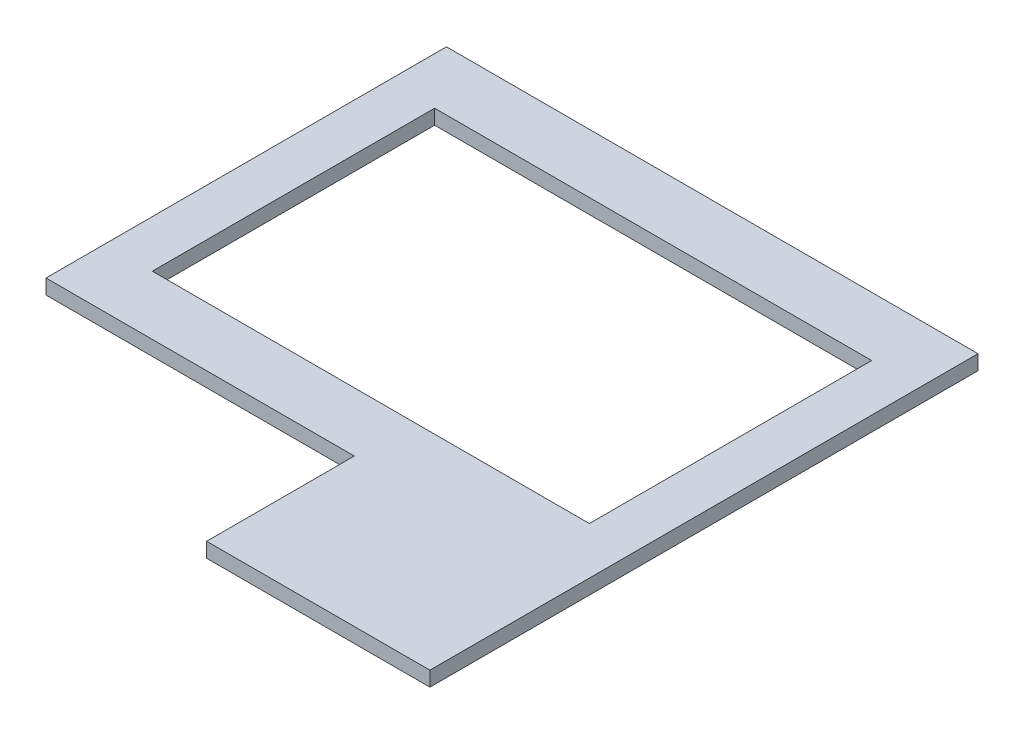
ISO-10303-21;
HEADER;
FILE_DESCRIPTION(('STEP AP214'),'2;1');
FILE_NAME('part.step','',(''),(''),'','','');
FILE_SCHEMA(('AUTOMOTIVE_DESIGN { 1 0 10303 214 1 1 1 1 }'));
ENDSEC;
DATA;
#1=APPLICATION_CONTEXT('core data for automotive mechanical design processes');
#2=APPLICATION_PROTOCOL_DEFINITION('international standard','automotive_design',2000,#1);
#3=PRODUCT_CONTEXT('',#1,'mechanical');
#4=PRODUCT('Part','Part','',(#3));
#5=PRODUCT_RELATED_PRODUCT_CATEGORY('part','',(#4));
#6=PRODUCT_DEFINITION_FORMATION('','',#4);
#7=PRODUCT_DEFINITION_CONTEXT('part definition',#1,'design');
#8=PRODUCT_DEFINITION('design','',#6,#7);
#9=PRODUCT_DEFINITION_SHAPE('','',#8);
#10=(LENGTH_UNIT() NAMED_UNIT(*) SI_UNIT(.MILLI.,.METRE.));
#11=(NAMED_UNIT(*) PLANE_ANGLE_UNIT() SI_UNIT($,.RADIAN.));
#12=(NAMED_UNIT(*) SI_UNIT($,.STERADIAN.) SOLID_ANGLE_UNIT());
#13=UNCERTAINTY_MEASURE_WITH_UNIT(LENGTH_MEASURE(1.E-05),#10,'distance_accuracy_value','');
#14=(GEOMETRIC_REPRESENTATION_CONTEXT(3) GLOBAL_UNCERTAINTY_ASSIGNED_CONTEXT((#13)) GLOBAL_UNIT_ASSIGNED_CONTEXT((#10,
#11,#12)) REPRESENTATION_CONTEXT('',''));
#15=CARTESIAN_POINT('',(0.,0.,0.));
#16=DIRECTION('',(0.,0.,1.));
#17=DIRECTION('',(1.,0.,0.));
#18=AXIS2_PLACEMENT_3D('',#15,#16,#17);
#19=CARTESIAN_POINT('',(0.,15.875,0.));
#20=DIRECTION('',(0.,0.,-1.));
#21=DIRECTION('',(-1.,0.,0.));
#22=AXIS2_PLACEMENT_3D('',#19,#20,#21);
#23=PLANE('',#22);
#24=DIRECTION('',(0.,-1.,0.));
#25=VECTOR('',#24,1.);
#26=CARTESIAN_POINT('',(331.47,-436.898064226508,0.));
#27=LINE('',#26,#25);
#28=CARTESIAN_POINT('',(331.47,15.875,0.));
#29=VERTEX_POINT('',#28);
#30=CARTESIAN_POINT('',(331.47,0.,0.));
#31=VERTEX_POINT('',#30);
#32=EDGE_CURVE('E49',#29,#31,#27,.T.);
#33=ORIENTED_EDGE('',*,*,#32,.F.);
#34=DIRECTION('',(1.,0.,0.));
#35=VECTOR('',#34,1.);
#36=CARTESIAN_POINT('',(0.,15.875,0.));
#37=LINE('',#36,#35);
#38=CARTESIAN_POINT('',(0.,15.875,0.));
#39=VERTEX_POINT('',#38);
#40=EDGE_CURVE('E134',#39,#29,#37,.T.);
#41=ORIENTED_EDGE('',*,*,#40,.F.);
#42=DIRECTION('',(0.,-1.,0.));
#43=VECTOR('',#42,1.);
#44=CARTESIAN_POINT('',(0.,15.875,0.));
#45=LINE('',#44,#43);
#46=CARTESIAN_POINT('',(0.,0.,0.));
#47=VERTEX_POINT('',#46);
#48=EDGE_CURVE('E11',#39,#47,#45,.T.);
#49=ORIENTED_EDGE('',*,*,#48,.T.);
#50=DIRECTION('',(1.,0.,0.));
#51=VECTOR('',#50,1.);
#52=CARTESIAN_POINT('',(0.,0.,0.));
#53=LINE('',#52,#51);
#54=EDGE_CURVE('E188',#47,#31,#53,.T.);
#55=ORIENTED_EDGE('',*,*,#54,.T.);
#56=EDGE_LOOP('',(#33,#41,#49,#55));
#57=FACE_BOUND('',#56,.T.);
#58=ADVANCED_FACE('F32',(#57),#23,.F.);
#59=CARTESIAN_POINT('',(0.,15.875,-430.53));
#60=DIRECTION('',(0.,-1.,0.));
#61=DIRECTION('',(0.,0.,-1.));
#62=AXIS2_PLACEMENT_3D('',#59,#60,#61);
#63=PLANE('',#62);
#64=DIRECTION('',(0.,0.,1.));
#65=VECTOR('',#64,1.);
#66=CARTESIAN_POINT('',(0.,15.875,0.));
#67=LINE('',#66,#65);
#68=CARTESIAN_POINT('',(0.,15.875,-430.53));
#69=VERTEX_POINT('',#68);
#70=EDGE_CURVE('E177',#69,#39,#67,.T.);
#71=ORIENTED_EDGE('',*,*,#70,.T.);
#72=ORIENTED_EDGE('',*,*,#40,.T.);
#73=DIRECTION('',(0.,0.,-1.));
#74=VECTOR('',#73,1.);
#75=CARTESIAN_POINT('',(331.47,15.875,158.75));
#76=LINE('',#75,#74);
#77=CARTESIAN_POINT('',(331.47,15.875,158.75));
#78=VERTEX_POINT('',#77);
#79=EDGE_CURVE('E115',#78,#29,#76,.T.);
#80=ORIENTED_EDGE('',*,*,#79,.F.);
#81=DIRECTION('',(-1.,0.,0.));
#82=VECTOR('',#81,1.);
#83=CARTESIAN_POINT('',(285.75,15.875,158.75));
#84=LINE('',#83,#82);
#85=CARTESIAN_POINT('',(571.5,15.875,158.75));
#86=VERTEX_POINT('',#85);
#87=EDGE_CURVE('E122',#86,#78,#84,.T.);
#88=ORIENTED_EDGE('',*,*,#87,.F.);
#89=DIRECTION('',(0.,0.,-1.));
#90=VECTOR('',#89,1.);
#91=CARTESIAN_POINT('',(571.5,15.875,0.));
#92=LINE('',#91,#90);
#93=CARTESIAN_POINT('',(571.5,15.875,-430.53));
#94=VERTEX_POINT('',#93);
#95=EDGE_CURVE('E181',#86,#94,#92,.T.);
#96=ORIENTED_EDGE('',*,*,#95,.T.);
#97=DIRECTION('',(-1.,0.,0.));
#98=VECTOR('',#97,1.);
#99=CARTESIAN_POINT('',(0.,15.875,-430.53));
#100=LINE('',#99,#98);
#101=EDGE_CURVE('E183',#94,#69,#100,.T.);
#102=ORIENTED_EDGE('',*,*,#101,.T.);
#103=EDGE_LOOP('',(#71,#72,#80,#88,#96,#102));
#104=FACE_BOUND('',#103,.T.);
#105=DIRECTION('',(0.,0.,1.));
#106=VECTOR('',#105,1.);
#107=CARTESIAN_POINT('',(50.8,15.875,-63.5));
#108=LINE('',#107,#106);
#109=CARTESIAN_POINT('',(50.8,15.875,-367.03));
#110=VERTEX_POINT('',#109);
#111=CARTESIAN_POINT('',(50.8,15.875,-63.5));
#112=VERTEX_POINT('',#111);
#113=EDGE_CURVE('E151',#110,#112,#108,.T.);
#114=ORIENTED_EDGE('',*,*,#113,.F.);
#115=DIRECTION('',(-1.,0.,0.));
#116=VECTOR('',#115,1.);
#117=CARTESIAN_POINT('',(50.8,15.875,-367.03));
#118=LINE('',#117,#116);
#119=CARTESIAN_POINT('',(520.7,15.875,-367.03));
#120=VERTEX_POINT('',#119);
#121=EDGE_CURVE('E158',#120,#110,#118,.T.);
#122=ORIENTED_EDGE('',*,*,#121,.F.);
#123=DIRECTION('',(0.,0.,-1.));
#124=VECTOR('',#123,1.);
#125=CARTESIAN_POINT('',(520.7,15.875,-63.5));
#126=LINE('',#125,#124);
#127=CARTESIAN_POINT('',(520.7,15.875,-63.5));
#128=VERTEX_POINT('',#127);
#129=EDGE_CURVE('E156',#128,#120,#126,.T.);
#130=ORIENTED_EDGE('',*,*,#129,.F.);
#131=DIRECTION('',(1.,0.,0.));
#132=VECTOR('',#131,1.);
#133=CARTESIAN_POINT('',(50.8,15.875,-63.5));
#134=LINE('',#133,#132);
#135=EDGE_CURVE('E153',#112,#128,#134,.T.);
#136=ORIENTED_EDGE('',*,*,#135,.F.);
#137=EDGE_LOOP('',(#114,#122,#130,#136));
#138=FACE_BOUND('',#137,.T.);
#139=ADVANCED_FACE('F132',(#104,#138),#63,.F.);
#140=CARTESIAN_POINT('',(0.,0.,-430.53));
#141=DIRECTION('',(0.,-1.,0.));
#142=DIRECTION('',(0.,0.,-1.));
#143=AXIS2_PLACEMENT_3D('',#140,#141,#142);
#144=PLANE('',#143);
#145=DIRECTION('',(0.,0.,1.));
#146=VECTOR('',#145,1.);
#147=CARTESIAN_POINT('',(0.,0.,0.));
#148=LINE('',#147,#146);
#149=CARTESIAN_POINT('',(0.,0.,-430.53));
#150=VERTEX_POINT('',#149);
#151=EDGE_CURVE('E176',#150,#47,#148,.T.);
#152=ORIENTED_EDGE('',*,*,#151,.F.);
#153=DIRECTION('',(-1.,0.,0.));
#154=VECTOR('',#153,1.);
#155=CARTESIAN_POINT('',(0.,0.,-430.53));
#156=LINE('',#155,#154);
#157=CARTESIAN_POINT('',(571.5,0.,-430.53));
#158=VERTEX_POINT('',#157);
#159=EDGE_CURVE('E178',#158,#150,#156,.T.);
#160=ORIENTED_EDGE('',*,*,#159,.F.);
#161=DIRECTION('',(0.,0.,-1.));
#162=VECTOR('',#161,1.);
#163=CARTESIAN_POINT('',(571.5,0.,0.));
#164=LINE('',#163,#162);
#165=CARTESIAN_POINT('',(571.5,0.,158.75));
#166=VERTEX_POINT('',#165);
#167=EDGE_CURVE('E191',#166,#158,#164,.T.);
#168=ORIENTED_EDGE('',*,*,#167,.F.);
#169=DIRECTION('',(1.,0.,0.));
#170=VECTOR('',#169,1.);
#171=CARTESIAN_POINT('',(285.75,0.,158.75));
#172=LINE('',#171,#170);
#173=CARTESIAN_POINT('',(331.47,0.,158.75));
#174=VERTEX_POINT('',#173);
#175=EDGE_CURVE('E121',#174,#166,#172,.T.);
#176=ORIENTED_EDGE('',*,*,#175,.F.);
#177=DIRECTION('',(0.,0.,-1.));
#178=VECTOR('',#177,1.);
#179=CARTESIAN_POINT('',(331.47,0.,158.75));
#180=LINE('',#179,#178);
#181=EDGE_CURVE('E117',#174,#31,#180,.T.);
#182=ORIENTED_EDGE('',*,*,#181,.T.);
#183=ORIENTED_EDGE('',*,*,#54,.F.);
#184=EDGE_LOOP('',(#152,#160,#168,#176,#182,#183));
#185=FACE_BOUND('',#184,.T.);
#186=DIRECTION('',(-1.,0.,0.));
#187=VECTOR('',#186,1.);
#188=CARTESIAN_POINT('',(50.8,0.,-367.03));
#189=LINE('',#188,#187);
#190=CARTESIAN_POINT('',(520.7,0.,-367.03));
#191=VERTEX_POINT('',#190);
#192=CARTESIAN_POINT('',(50.8,0.,-367.03));
#193=VERTEX_POINT('',#192);
#194=EDGE_CURVE('E154',#191,#193,#189,.T.);
#195=ORIENTED_EDGE('',*,*,#194,.T.);
#196=DIRECTION('',(0.,0.,1.));
#197=VECTOR('',#196,1.);
#198=CARTESIAN_POINT('',(50.8,0.,-63.5));
#199=LINE('',#198,#197);
#200=CARTESIAN_POINT('',(50.8,0.,-63.5));
#201=VERTEX_POINT('',#200);
#202=EDGE_CURVE('E135',#193,#201,#199,.T.);
#203=ORIENTED_EDGE('',*,*,#202,.T.);
#204=DIRECTION('',(1.,0.,0.));
#205=VECTOR('',#204,1.);
#206=CARTESIAN_POINT('',(50.8,0.,-63.5));
#207=LINE('',#206,#205);
#208=CARTESIAN_POINT('',(520.7,0.,-63.5));
#209=VERTEX_POINT('',#208);
#210=EDGE_CURVE('E137',#201,#209,#207,.T.);
#211=ORIENTED_EDGE('',*,*,#210,.T.);
#212=DIRECTION('',(0.,0.,-1.));
#213=VECTOR('',#212,1.);
#214=CARTESIAN_POINT('',(520.7,0.,-63.5));
#215=LINE('',#214,#213);
#216=EDGE_CURVE('E163',#209,#191,#215,.T.);
#217=ORIENTED_EDGE('',*,*,#216,.T.);
#218=EDGE_LOOP('',(#195,#203,#211,#217));
#219=FACE_BOUND('',#218,.T.);
#220=ADVANCED_FACE('F207',(#185,#219),#144,.T.);
#221=CARTESIAN_POINT('',(0.,15.875,0.));
#222=DIRECTION('',(1.,0.,0.));
#223=DIRECTION('',(0.,0.,-1.));
#224=AXIS2_PLACEMENT_3D('',#221,#222,#223);
#225=PLANE('',#224);
#226=ORIENTED_EDGE('',*,*,#151,.T.);
#227=ORIENTED_EDGE('',*,*,#48,.F.);
#228=ORIENTED_EDGE('',*,*,#70,.F.);
#229=DIRECTION('',(0.,-1.,0.));
#230=VECTOR('',#229,1.);
#231=CARTESIAN_POINT('',(0.,15.875,-430.53));
#232=LINE('',#231,#230);
#233=EDGE_CURVE('E185',#69,#150,#232,.T.);
#234=ORIENTED_EDGE('',*,*,#233,.T.);
#235=EDGE_LOOP('',(#226,#227,#228,#234));
#236=FACE_BOUND('',#235,.T.);
#237=ADVANCED_FACE('F34',(#236),#225,.F.);
#238=CARTESIAN_POINT('',(571.5,15.875,0.));
#239=DIRECTION('',(-1.,0.,0.));
#240=DIRECTION('',(0.,0.,1.));
#241=AXIS2_PLACEMENT_3D('',#238,#239,#240);
#242=PLANE('',#241);
#243=ORIENTED_EDGE('',*,*,#167,.T.);
#244=DIRECTION('',(0.,-1.,0.));
#245=VECTOR('',#244,1.);
#246=CARTESIAN_POINT('',(571.5,15.875,-430.53));
#247=LINE('',#246,#245);
#248=EDGE_CURVE('E41',#94,#158,#247,.T.);
#249=ORIENTED_EDGE('',*,*,#248,.F.);
#250=ORIENTED_EDGE('',*,*,#95,.F.);
#251=DIRECTION('',(0.,1.,0.));
#252=VECTOR('',#251,1.);
#253=CARTESIAN_POINT('',(571.5,-436.898064226508,158.75));
#254=LINE('',#253,#252);
#255=EDGE_CURVE('E128',#166,#86,#254,.T.);
#256=ORIENTED_EDGE('',*,*,#255,.F.);
#257=EDGE_LOOP('',(#243,#249,#250,#256));
#258=FACE_BOUND('',#257,.T.);
#259=ADVANCED_FACE('F202',(#258),#242,.F.);
#260=CARTESIAN_POINT('',(0.,15.875,-430.53));
#261=DIRECTION('',(0.,0.,1.));
#262=DIRECTION('',(1.,0.,0.));
#263=AXIS2_PLACEMENT_3D('',#260,#261,#262);
#264=PLANE('',#263);
#265=ORIENTED_EDGE('',*,*,#159,.T.);
#266=ORIENTED_EDGE('',*,*,#233,.F.);
#267=ORIENTED_EDGE('',*,*,#101,.F.);
#268=ORIENTED_EDGE('',*,*,#248,.T.);
#269=EDGE_LOOP('',(#265,#266,#267,#268));
#270=FACE_BOUND('',#269,.T.);
#271=ADVANCED_FACE('F205',(#270),#264,.F.);
#272=CARTESIAN_POINT('',(50.8,15.875,-63.5));
#273=DIRECTION('',(1.,0.,0.));
#274=DIRECTION('',(0.,0.,-1.));
#275=AXIS2_PLACEMENT_3D('',#272,#273,#274);
#276=PLANE('',#275);
#277=ORIENTED_EDGE('',*,*,#202,.F.);
#278=DIRECTION('',(0.,-1.,0.));
#279=VECTOR('',#278,1.);
#280=CARTESIAN_POINT('',(50.8,15.875,-367.03));
#281=LINE('',#280,#279);
#282=EDGE_CURVE('E159',#110,#193,#281,.T.);
#283=ORIENTED_EDGE('',*,*,#282,.F.);
#284=ORIENTED_EDGE('',*,*,#113,.T.);
#285=DIRECTION('',(0.,-1.,0.));
#286=VECTOR('',#285,1.);
#287=CARTESIAN_POINT('',(50.8,15.875,-63.5));
#288=LINE('',#287,#286);
#289=EDGE_CURVE('E173',#112,#201,#288,.T.);
#290=ORIENTED_EDGE('',*,*,#289,.T.);
#291=EDGE_LOOP('',(#277,#283,#284,#290));
#292=FACE_BOUND('',#291,.T.);
#293=ADVANCED_FACE('F222',(#292),#276,.T.);
#294=CARTESIAN_POINT('',(50.8,15.875,-63.5));
#295=DIRECTION('',(0.,0.,-1.));
#296=DIRECTION('',(-1.,0.,0.));
#297=AXIS2_PLACEMENT_3D('',#294,#295,#296);
#298=PLANE('',#297);
#299=ORIENTED_EDGE('',*,*,#210,.F.);
#300=ORIENTED_EDGE('',*,*,#289,.F.);
#301=ORIENTED_EDGE('',*,*,#135,.T.);
#302=DIRECTION('',(0.,-1.,0.));
#303=VECTOR('',#302,1.);
#304=CARTESIAN_POINT('',(520.7,15.875,-63.5));
#305=LINE('',#304,#303);
#306=EDGE_CURVE('E171',#128,#209,#305,.T.);
#307=ORIENTED_EDGE('',*,*,#306,.T.);
#308=EDGE_LOOP('',(#299,#300,#301,#307));
#309=FACE_BOUND('',#308,.T.);
#310=ADVANCED_FACE('F227',(#309),#298,.T.);
#311=CARTESIAN_POINT('',(520.7,15.875,-63.5));
#312=DIRECTION('',(-1.,0.,0.));
#313=DIRECTION('',(0.,0.,1.));
#314=AXIS2_PLACEMENT_3D('',#311,#312,#313);
#315=PLANE('',#314);
#316=ORIENTED_EDGE('',*,*,#216,.F.);
#317=ORIENTED_EDGE('',*,*,#306,.F.);
#318=ORIENTED_EDGE('',*,*,#129,.T.);
#319=DIRECTION('',(0.,-1.,0.));
#320=VECTOR('',#319,1.);
#321=CARTESIAN_POINT('',(520.7,15.875,-367.03));
#322=LINE('',#321,#320);
#323=EDGE_CURVE('E57',#120,#191,#322,.T.);
#324=ORIENTED_EDGE('',*,*,#323,.T.);
#325=EDGE_LOOP('',(#316,#317,#318,#324));
#326=FACE_BOUND('',#325,.T.);
#327=ADVANCED_FACE('F231',(#326),#315,.T.);
#328=CARTESIAN_POINT('',(50.8,15.875,-367.03));
#329=DIRECTION('',(0.,0.,1.));
#330=DIRECTION('',(1.,0.,0.));
#331=AXIS2_PLACEMENT_3D('',#328,#329,#330);
#332=PLANE('',#331);
#333=ORIENTED_EDGE('',*,*,#194,.F.);
#334=ORIENTED_EDGE('',*,*,#323,.F.);
#335=ORIENTED_EDGE('',*,*,#121,.T.);
#336=ORIENTED_EDGE('',*,*,#282,.T.);
#337=EDGE_LOOP('',(#333,#334,#335,#336));
#338=FACE_BOUND('',#337,.T.);
#339=ADVANCED_FACE('F235',(#338),#332,.T.);
#340=CARTESIAN_POINT('',(331.47,-436.898064226508,158.75));
#341=DIRECTION('',(1.,0.,0.));
#342=DIRECTION('',(0.,0.,-1.));
#343=AXIS2_PLACEMENT_3D('',#340,#341,#342);
#344=PLANE('',#343);
#345=ORIENTED_EDGE('',*,*,#32,.T.);
#346=ORIENTED_EDGE('',*,*,#181,.F.);
#347=DIRECTION('',(0.,-1.,0.));
#348=VECTOR('',#347,1.);
#349=CARTESIAN_POINT('',(331.47,-436.898064226508,158.75));
#350=LINE('',#349,#348);
#351=EDGE_CURVE('E111',#78,#174,#350,.T.);
#352=ORIENTED_EDGE('',*,*,#351,.F.);
#353=ORIENTED_EDGE('',*,*,#79,.T.);
#354=EDGE_LOOP('',(#345,#346,#352,#353));
#355=FACE_BOUND('',#354,.T.);
#356=ADVANCED_FACE('F113',(#355),#344,.F.);
#357=CARTESIAN_POINT('',(285.75,-436.898064226508,158.75));
#358=DIRECTION('',(0.,0.,1.));
#359=DIRECTION('',(1.,0.,0.));
#360=AXIS2_PLACEMENT_3D('',#357,#358,#359);
#361=PLANE('',#360);
#362=ORIENTED_EDGE('',*,*,#87,.T.);
#363=ORIENTED_EDGE('',*,*,#351,.T.);
#364=ORIENTED_EDGE('',*,*,#175,.T.);
#365=ORIENTED_EDGE('',*,*,#255,.T.);
#366=EDGE_LOOP('',(#362,#363,#364,#365));
#367=FACE_BOUND('',#366,.T.);
#368=ADVANCED_FACE('F126',(#367),#361,.T.);
#369=CLOSED_SHELL('',(#58,#139,#220,#237,#259,#271,#293,#310,#327,#339,#356,#368));
#370=MANIFOLD_SOLID_BREP('B2',#369);
#371=ADVANCED_BREP_SHAPE_REPRESENTATION('',(#18,#370),#14);
#372=SHAPE_DEFINITION_REPRESENTATION(#9,#371);
ENDSEC;
END-ISO-10303-21;
